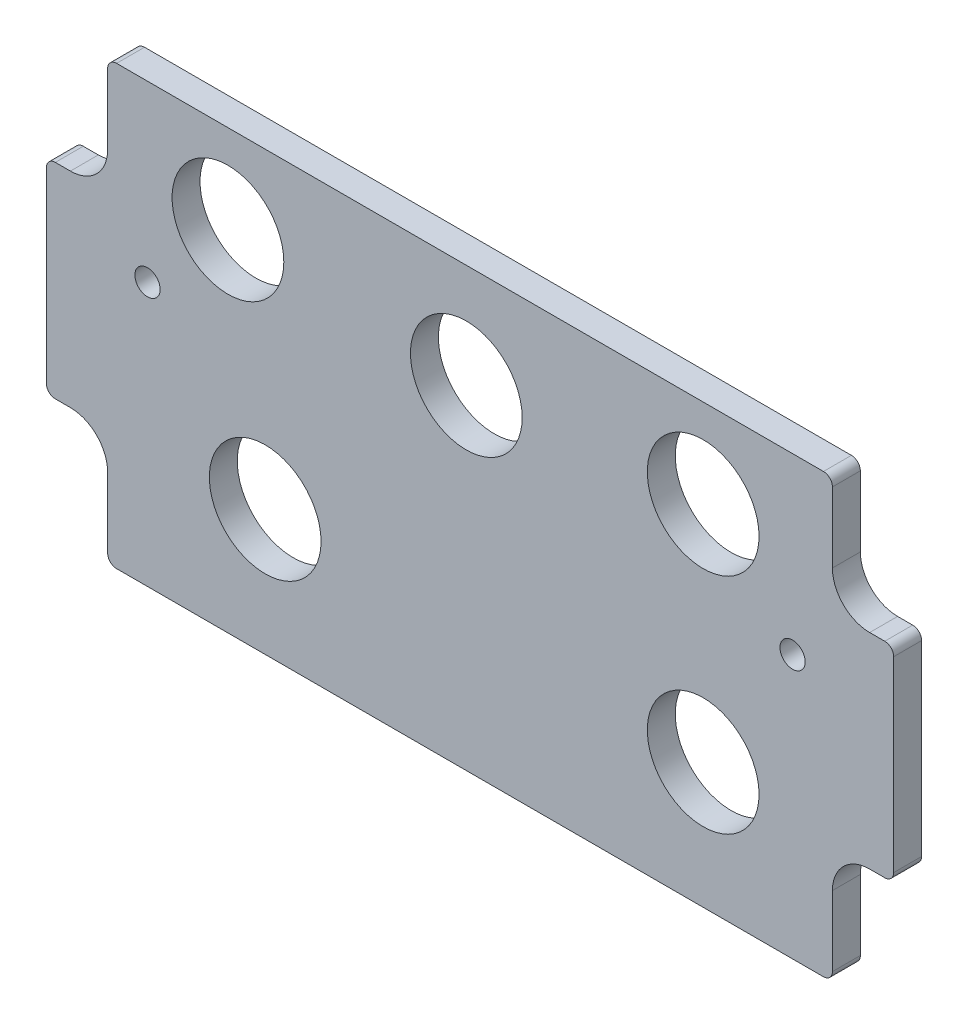
ISO-10303-21;
HEADER;
FILE_DESCRIPTION(('STEP AP214'),'2;1');
FILE_NAME('part.step','',(''),(''),'','','');
FILE_SCHEMA(('AUTOMOTIVE_DESIGN { 1 0 10303 214 1 1 1 1 }'));
ENDSEC;
DATA;
#1=APPLICATION_CONTEXT('core data for automotive mechanical design processes');
#2=APPLICATION_PROTOCOL_DEFINITION('international standard','automotive_design',2000,#1);
#3=PRODUCT_CONTEXT('',#1,'mechanical');
#4=PRODUCT('Part','Part','',(#3));
#5=PRODUCT_RELATED_PRODUCT_CATEGORY('part','',(#4));
#6=PRODUCT_DEFINITION_FORMATION('','',#4);
#7=PRODUCT_DEFINITION_CONTEXT('part definition',#1,'design');
#8=PRODUCT_DEFINITION('design','',#6,#7);
#9=PRODUCT_DEFINITION_SHAPE('','',#8);
#10=(LENGTH_UNIT() NAMED_UNIT(*) SI_UNIT(.MILLI.,.METRE.));
#11=(NAMED_UNIT(*) PLANE_ANGLE_UNIT() SI_UNIT($,.RADIAN.));
#12=(NAMED_UNIT(*) SI_UNIT($,.STERADIAN.) SOLID_ANGLE_UNIT());
#13=UNCERTAINTY_MEASURE_WITH_UNIT(LENGTH_MEASURE(1.E-05),#10,'distance_accuracy_value','');
#14=(GEOMETRIC_REPRESENTATION_CONTEXT(3) GLOBAL_UNCERTAINTY_ASSIGNED_CONTEXT((#13)) GLOBAL_UNIT_ASSIGNED_CONTEXT((#10,
#11,#12)) REPRESENTATION_CONTEXT('',''));
#15=CARTESIAN_POINT('',(0.,0.,0.));
#16=DIRECTION('',(0.,0.,1.));
#17=DIRECTION('',(1.,0.,0.));
#18=AXIS2_PLACEMENT_3D('',#15,#16,#17);
#19=CARTESIAN_POINT('',(141.1605,61.9125,4.7625));
#20=DIRECTION('',(0.,0.,-1.));
#21=DIRECTION('',(-1.,0.,0.));
#22=AXIS2_PLACEMENT_3D('',#19,#20,#21);
#23=CYLINDRICAL_SURFACE('',#22,6.34999999999994);
#24=CARTESIAN_POINT('',(141.1605,61.9125,0.));
#25=DIRECTION('',(0.,0.,-1.));
#26=DIRECTION('',(1.,0.,0.));
#27=AXIS2_PLACEMENT_3D('',#24,#25,#26);
#28=CIRCLE('',#27,6.34999999999994);
#29=CARTESIAN_POINT('',(141.160500000001,55.5625000000001,0.));
#30=VERTEX_POINT('',#29);
#31=CARTESIAN_POINT('',(134.8105,61.9125,0.));
#32=VERTEX_POINT('',#31);
#33=EDGE_CURVE('E243',#30,#32,#28,.T.);
#34=ORIENTED_EDGE('',*,*,#33,.T.);
#35=DIRECTION('',(0.,0.,-1.));
#36=VECTOR('',#35,1.);
#37=CARTESIAN_POINT('',(134.8105,61.9125,4.7625));
#38=LINE('',#37,#36);
#39=CARTESIAN_POINT('',(134.8105,61.9125,4.7625));
#40=VERTEX_POINT('',#39);
#41=EDGE_CURVE('E13',#40,#32,#38,.T.);
#42=ORIENTED_EDGE('',*,*,#41,.F.);
#43=CARTESIAN_POINT('',(141.1605,61.9125,4.7625));
#44=DIRECTION('',(0.,0.,-1.));
#45=DIRECTION('',(1.,0.,0.));
#46=AXIS2_PLACEMENT_3D('',#43,#44,#45);
#47=CIRCLE('',#46,6.34999999999994);
#48=CARTESIAN_POINT('',(141.160500000001,55.5625000000001,4.7625));
#49=VERTEX_POINT('',#48);
#50=EDGE_CURVE('E290',#49,#40,#47,.T.);
#51=ORIENTED_EDGE('',*,*,#50,.F.);
#52=DIRECTION('',(0.,0.,-1.));
#53=VECTOR('',#52,1.);
#54=CARTESIAN_POINT('',(141.160500000001,55.5625000000001,4.7625));
#55=LINE('',#54,#53);
#56=EDGE_CURVE('E239',#49,#30,#55,.T.);
#57=ORIENTED_EDGE('',*,*,#56,.T.);
#58=EDGE_LOOP('',(#34,#42,#51,#57));
#59=FACE_BOUND('',#58,.T.);
#60=ADVANCED_FACE('F51',(#59),#23,.F.);
#61=CARTESIAN_POINT('',(134.8105,61.9125,4.7625));
#62=DIRECTION('',(-1.,0.,0.));
#63=DIRECTION('',(0.,-1.,0.));
#64=AXIS2_PLACEMENT_3D('',#61,#62,#63);
#65=PLANE('',#64);
#66=DIRECTION('',(0.,1.,0.));
#67=VECTOR('',#66,1.);
#68=CARTESIAN_POINT('',(134.8105,61.9125,0.));
#69=LINE('',#68,#67);
#70=CARTESIAN_POINT('',(134.8105,73.88225,0.));
#71=VERTEX_POINT('',#70);
#72=EDGE_CURVE('E246',#32,#71,#69,.T.);
#73=ORIENTED_EDGE('',*,*,#72,.T.);
#74=DIRECTION('',(0.,0.,-1.));
#75=VECTOR('',#74,1.);
#76=CARTESIAN_POINT('',(134.8105,73.88225,4.7625));
#77=LINE('',#76,#75);
#78=CARTESIAN_POINT('',(134.8105,73.88225,4.7625));
#79=VERTEX_POINT('',#78);
#80=EDGE_CURVE('E59',#79,#71,#77,.T.);
#81=ORIENTED_EDGE('',*,*,#80,.F.);
#82=DIRECTION('',(0.,1.,0.));
#83=VECTOR('',#82,1.);
#84=CARTESIAN_POINT('',(134.8105,61.9125,4.7625));
#85=LINE('',#84,#83);
#86=EDGE_CURVE('E158',#40,#79,#85,.T.);
#87=ORIENTED_EDGE('',*,*,#86,.F.);
#88=ORIENTED_EDGE('',*,*,#41,.T.);
#89=EDGE_LOOP('',(#73,#81,#87,#88));
#90=FACE_BOUND('',#89,.T.);
#91=ADVANCED_FACE('F429',(#90),#65,.F.);
#92=CARTESIAN_POINT('',(133.2865,73.88225,4.7625));
#93=DIRECTION('',(0.,0.,-1.));
#94=DIRECTION('',(-1.,0.,0.));
#95=AXIS2_PLACEMENT_3D('',#92,#93,#94);
#96=CYLINDRICAL_SURFACE('',#95,1.52400000000003);
#97=CARTESIAN_POINT('',(133.2865,73.88225,0.));
#98=DIRECTION('',(0.,0.,1.));
#99=DIRECTION('',(1.,0.,0.));
#100=AXIS2_PLACEMENT_3D('',#97,#98,#99);
#101=CIRCLE('',#100,1.52400000000003);
#102=CARTESIAN_POINT('',(133.2865,75.40625,0.));
#103=VERTEX_POINT('',#102);
#104=EDGE_CURVE('E249',#71,#103,#101,.T.);
#105=ORIENTED_EDGE('',*,*,#104,.T.);
#106=DIRECTION('',(0.,0.,-1.));
#107=VECTOR('',#106,1.);
#108=CARTESIAN_POINT('',(133.2865,75.40625,4.7625));
#109=LINE('',#108,#107);
#110=CARTESIAN_POINT('',(133.2865,75.40625,4.7625));
#111=VERTEX_POINT('',#110);
#112=EDGE_CURVE('E345',#111,#103,#109,.T.);
#113=ORIENTED_EDGE('',*,*,#112,.F.);
#114=CARTESIAN_POINT('',(133.2865,73.88225,4.7625));
#115=DIRECTION('',(0.,0.,1.));
#116=DIRECTION('',(1.,0.,0.));
#117=AXIS2_PLACEMENT_3D('',#114,#115,#116);
#118=CIRCLE('',#117,1.52400000000003);
#119=EDGE_CURVE('E353',#79,#111,#118,.T.);
#120=ORIENTED_EDGE('',*,*,#119,.F.);
#121=ORIENTED_EDGE('',*,*,#80,.T.);
#122=EDGE_LOOP('',(#105,#113,#120,#121));
#123=FACE_BOUND('',#122,.T.);
#124=ADVANCED_FACE('F351',(#123),#96,.T.);
#125=CARTESIAN_POINT('',(133.2865,75.40625,4.7625));
#126=DIRECTION('',(0.,-1.,0.));
#127=DIRECTION('',(0.,0.,-1.));
#128=AXIS2_PLACEMENT_3D('',#125,#126,#127);
#129=PLANE('',#128);
#130=DIRECTION('',(-1.,0.,0.));
#131=VECTOR('',#130,1.);
#132=CARTESIAN_POINT('',(133.2865,75.40625,0.));
#133=LINE('',#132,#131);
#134=CARTESIAN_POINT('',(12.7635000000002,75.40625,0.));
#135=VERTEX_POINT('',#134);
#136=EDGE_CURVE('E251',#103,#135,#133,.T.);
#137=ORIENTED_EDGE('',*,*,#136,.T.);
#138=DIRECTION('',(0.,0.,-1.));
#139=VECTOR('',#138,1.);
#140=CARTESIAN_POINT('',(12.7635000000002,75.40625,4.7625));
#141=LINE('',#140,#139);
#142=CARTESIAN_POINT('',(12.7635000000002,75.40625,4.7625));
#143=VERTEX_POINT('',#142);
#144=EDGE_CURVE('E342',#143,#135,#141,.T.);
#145=ORIENTED_EDGE('',*,*,#144,.F.);
#146=DIRECTION('',(-1.,0.,0.));
#147=VECTOR('',#146,1.);
#148=CARTESIAN_POINT('',(133.2865,75.40625,4.7625));
#149=LINE('',#148,#147);
#150=EDGE_CURVE('E371',#111,#143,#149,.T.);
#151=ORIENTED_EDGE('',*,*,#150,.F.);
#152=ORIENTED_EDGE('',*,*,#112,.T.);
#153=EDGE_LOOP('',(#137,#145,#151,#152));
#154=FACE_BOUND('',#153,.T.);
#155=ADVANCED_FACE('F362',(#154),#129,.F.);
#156=CARTESIAN_POINT('',(12.7635000000002,73.88225,4.7625));
#157=DIRECTION('',(0.,0.,-1.));
#158=DIRECTION('',(-1.,0.,0.));
#159=AXIS2_PLACEMENT_3D('',#156,#157,#158);
#160=CYLINDRICAL_SURFACE('',#159,1.524);
#161=CARTESIAN_POINT('',(12.7635000000002,73.88225,0.));
#162=DIRECTION('',(0.,0.,1.));
#163=DIRECTION('',(1.,0.,0.));
#164=AXIS2_PLACEMENT_3D('',#161,#162,#163);
#165=CIRCLE('',#164,1.524);
#166=CARTESIAN_POINT('',(11.2395000000002,73.88225,0.));
#167=VERTEX_POINT('',#166);
#168=EDGE_CURVE('E253',#135,#167,#165,.T.);
#169=ORIENTED_EDGE('',*,*,#168,.T.);
#170=DIRECTION('',(0.,0.,-1.));
#171=VECTOR('',#170,1.);
#172=CARTESIAN_POINT('',(11.2395000000002,73.88225,4.7625));
#173=LINE('',#172,#171);
#174=CARTESIAN_POINT('',(11.2395000000002,73.88225,4.7625));
#175=VERTEX_POINT('',#174);
#176=EDGE_CURVE('E339',#175,#167,#173,.T.);
#177=ORIENTED_EDGE('',*,*,#176,.F.);
#178=CARTESIAN_POINT('',(12.7635000000002,73.88225,4.7625));
#179=DIRECTION('',(0.,0.,1.));
#180=DIRECTION('',(1.,0.,0.));
#181=AXIS2_PLACEMENT_3D('',#178,#179,#180);
#182=CIRCLE('',#181,1.524);
#183=EDGE_CURVE('E368',#143,#175,#182,.T.);
#184=ORIENTED_EDGE('',*,*,#183,.F.);
#185=ORIENTED_EDGE('',*,*,#144,.T.);
#186=EDGE_LOOP('',(#169,#177,#184,#185));
#187=FACE_BOUND('',#186,.T.);
#188=ADVANCED_FACE('F366',(#187),#160,.T.);
#189=CARTESIAN_POINT('',(11.2395000000002,73.88225,4.7625));
#190=DIRECTION('',(1.,0.,0.));
#191=DIRECTION('',(0.,1.,0.));
#192=AXIS2_PLACEMENT_3D('',#189,#190,#191);
#193=PLANE('',#192);
#194=DIRECTION('',(0.,-1.,0.));
#195=VECTOR('',#194,1.);
#196=CARTESIAN_POINT('',(11.2395000000002,73.88225,0.));
#197=LINE('',#196,#195);
#198=CARTESIAN_POINT('',(11.2395000000003,61.9125,0.));
#199=VERTEX_POINT('',#198);
#200=EDGE_CURVE('E255',#167,#199,#197,.T.);
#201=ORIENTED_EDGE('',*,*,#200,.T.);
#202=DIRECTION('',(0.,0.,-1.));
#203=VECTOR('',#202,1.);
#204=CARTESIAN_POINT('',(11.2395000000003,61.9125,4.7625));
#205=LINE('',#204,#203);
#206=CARTESIAN_POINT('',(11.2395000000003,61.9125,4.7625));
#207=VERTEX_POINT('',#206);
#208=EDGE_CURVE('E336',#207,#199,#205,.T.);
#209=ORIENTED_EDGE('',*,*,#208,.F.);
#210=DIRECTION('',(0.,-1.,0.));
#211=VECTOR('',#210,1.);
#212=CARTESIAN_POINT('',(11.2395000000002,73.88225,4.7625));
#213=LINE('',#212,#211);
#214=EDGE_CURVE('E370',#175,#207,#213,.T.);
#215=ORIENTED_EDGE('',*,*,#214,.F.);
#216=ORIENTED_EDGE('',*,*,#176,.T.);
#217=EDGE_LOOP('',(#201,#209,#215,#216));
#218=FACE_BOUND('',#217,.T.);
#219=ADVANCED_FACE('F442',(#218),#193,.F.);
#220=CARTESIAN_POINT('',(4.88950000000036,61.9125,4.7625));
#221=DIRECTION('',(0.,0.,-1.));
#222=DIRECTION('',(-1.,0.,0.));
#223=AXIS2_PLACEMENT_3D('',#220,#221,#222);
#224=CYLINDRICAL_SURFACE('',#223,6.34999999999997);
#225=CARTESIAN_POINT('',(4.88950000000036,61.9125,0.));
#226=DIRECTION('',(0.,0.,-1.));
#227=DIRECTION('',(1.,0.,0.));
#228=AXIS2_PLACEMENT_3D('',#225,#226,#227);
#229=CIRCLE('',#228,6.34999999999997);
#230=CARTESIAN_POINT('',(4.88950000000014,55.5625,0.));
#231=VERTEX_POINT('',#230);
#232=EDGE_CURVE('E257',#199,#231,#229,.T.);
#233=ORIENTED_EDGE('',*,*,#232,.T.);
#234=DIRECTION('',(0.,0.,-1.));
#235=VECTOR('',#234,1.);
#236=CARTESIAN_POINT('',(4.88950000000014,55.5625,4.7625));
#237=LINE('',#236,#235);
#238=CARTESIAN_POINT('',(4.88950000000014,55.5625,4.7625));
#239=VERTEX_POINT('',#238);
#240=EDGE_CURVE('E333',#239,#231,#237,.T.);
#241=ORIENTED_EDGE('',*,*,#240,.F.);
#242=CARTESIAN_POINT('',(4.88950000000036,61.9125,4.7625));
#243=DIRECTION('',(0.,0.,-1.));
#244=DIRECTION('',(1.,0.,0.));
#245=AXIS2_PLACEMENT_3D('',#242,#243,#244);
#246=CIRCLE('',#245,6.34999999999997);
#247=EDGE_CURVE('E373',#207,#239,#246,.T.);
#248=ORIENTED_EDGE('',*,*,#247,.F.);
#249=ORIENTED_EDGE('',*,*,#208,.T.);
#250=EDGE_LOOP('',(#233,#241,#248,#249));
#251=FACE_BOUND('',#250,.T.);
#252=ADVANCED_FACE('F445',(#251),#224,.F.);
#253=CARTESIAN_POINT('',(4.88950000000014,55.5625,4.7625));
#254=DIRECTION('',(0.,-1.,0.));
#255=DIRECTION('',(1.,0.,0.));
#256=AXIS2_PLACEMENT_3D('',#253,#254,#255);
#257=PLANE('',#256);
#258=DIRECTION('',(-1.,0.,0.));
#259=VECTOR('',#258,1.);
#260=CARTESIAN_POINT('',(4.88950000000014,55.5625,0.));
#261=LINE('',#260,#259);
#262=CARTESIAN_POINT('',(2.31775000000038,55.5625000000002,0.));
#263=VERTEX_POINT('',#262);
#264=EDGE_CURVE('E259',#231,#263,#261,.T.);
#265=ORIENTED_EDGE('',*,*,#264,.T.);
#266=DIRECTION('',(0.,0.,-1.));
#267=VECTOR('',#266,1.);
#268=CARTESIAN_POINT('',(2.31775000000038,55.5625000000002,4.7625));
#269=LINE('',#268,#267);
#270=CARTESIAN_POINT('',(2.31775000000038,55.5625000000002,4.7625));
#271=VERTEX_POINT('',#270);
#272=EDGE_CURVE('E330',#271,#263,#269,.T.);
#273=ORIENTED_EDGE('',*,*,#272,.F.);
#274=DIRECTION('',(-1.,0.,0.));
#275=VECTOR('',#274,1.);
#276=CARTESIAN_POINT('',(4.88950000000014,55.5625,4.7625));
#277=LINE('',#276,#275);
#278=EDGE_CURVE('E379',#239,#271,#277,.T.);
#279=ORIENTED_EDGE('',*,*,#278,.F.);
#280=ORIENTED_EDGE('',*,*,#240,.T.);
#281=EDGE_LOOP('',(#265,#273,#279,#280));
#282=FACE_BOUND('',#281,.T.);
#283=ADVANCED_FACE('F449',(#282),#257,.F.);
#284=CARTESIAN_POINT('',(2.31775000000033,54.0385000000003,4.7625));
#285=DIRECTION('',(0.,0.,-1.));
#286=DIRECTION('',(-1.,0.,0.));
#287=AXIS2_PLACEMENT_3D('',#284,#285,#286);
#288=CYLINDRICAL_SURFACE('',#287,1.52399999999997);
#289=CARTESIAN_POINT('',(2.31775000000033,54.0385000000003,0.));
#290=DIRECTION('',(0.,0.,1.));
#291=DIRECTION('',(1.,0.,0.));
#292=AXIS2_PLACEMENT_3D('',#289,#290,#291);
#293=CIRCLE('',#292,1.52399999999997);
#294=CARTESIAN_POINT('',(0.793750000000361,54.0385000000003,0.));
#295=VERTEX_POINT('',#294);
#296=EDGE_CURVE('E261',#263,#295,#293,.T.);
#297=ORIENTED_EDGE('',*,*,#296,.T.);
#298=DIRECTION('',(0.,0.,-1.));
#299=VECTOR('',#298,1.);
#300=CARTESIAN_POINT('',(0.79375000000036,54.0385000000003,4.7625));
#301=LINE('',#300,#299);
#302=CARTESIAN_POINT('',(0.79375000000036,54.0385000000003,4.7625));
#303=VERTEX_POINT('',#302);
#304=EDGE_CURVE('E327',#303,#295,#301,.T.);
#305=ORIENTED_EDGE('',*,*,#304,.F.);
#306=CARTESIAN_POINT('',(2.31775000000033,54.0385000000003,4.7625));
#307=DIRECTION('',(0.,0.,1.));
#308=DIRECTION('',(1.,0.,0.));
#309=AXIS2_PLACEMENT_3D('',#306,#307,#308);
#310=CIRCLE('',#309,1.52399999999997);
#311=EDGE_CURVE('E381',#271,#303,#310,.T.);
#312=ORIENTED_EDGE('',*,*,#311,.F.);
#313=ORIENTED_EDGE('',*,*,#272,.T.);
#314=EDGE_LOOP('',(#297,#305,#312,#313));
#315=FACE_BOUND('',#314,.T.);
#316=ADVANCED_FACE('F453',(#315),#288,.T.);
#317=CARTESIAN_POINT('',(0.793750000000328,54.0385000000003,4.7625));
#318=DIRECTION('',(1.,0.,0.));
#319=DIRECTION('',(0.,1.,0.));
#320=AXIS2_PLACEMENT_3D('',#317,#318,#319);
#321=PLANE('',#320);
#322=DIRECTION('',(0.,-1.,0.));
#323=VECTOR('',#322,1.);
#324=CARTESIAN_POINT('',(0.793750000000328,54.0385000000003,0.));
#325=LINE('',#324,#323);
#326=CARTESIAN_POINT('',(0.793750000000338,22.1614999999998,0.));
#327=VERTEX_POINT('',#326);
#328=EDGE_CURVE('E263',#295,#327,#325,.T.);
#329=ORIENTED_EDGE('',*,*,#328,.T.);
#330=DIRECTION('',(0.,0.,-1.));
#331=VECTOR('',#330,1.);
#332=CARTESIAN_POINT('',(0.793750000000338,22.1614999999998,4.7625));
#333=LINE('',#332,#331);
#334=CARTESIAN_POINT('',(0.793750000000338,22.1614999999998,4.7625));
#335=VERTEX_POINT('',#334);
#336=EDGE_CURVE('E324',#335,#327,#333,.T.);
#337=ORIENTED_EDGE('',*,*,#336,.F.);
#338=DIRECTION('',(0.,-1.,0.));
#339=VECTOR('',#338,1.);
#340=CARTESIAN_POINT('',(0.793750000000328,54.0385000000003,4.7625));
#341=LINE('',#340,#339);
#342=EDGE_CURVE('E383',#303,#335,#341,.T.);
#343=ORIENTED_EDGE('',*,*,#342,.F.);
#344=ORIENTED_EDGE('',*,*,#304,.T.);
#345=EDGE_LOOP('',(#329,#337,#343,#344));
#346=FACE_BOUND('',#345,.T.);
#347=ADVANCED_FACE('F457',(#346),#321,.F.);
#348=CARTESIAN_POINT('',(2.31775000000033,22.1614999999998,4.7625));
#349=DIRECTION('',(0.,0.,-1.));
#350=DIRECTION('',(-1.,0.,0.));
#351=AXIS2_PLACEMENT_3D('',#348,#349,#350);
#352=CYLINDRICAL_SURFACE('',#351,1.52399999999999);
#353=CARTESIAN_POINT('',(2.31775000000033,22.1614999999998,0.));
#354=DIRECTION('',(0.,0.,1.));
#355=DIRECTION('',(1.,0.,0.));
#356=AXIS2_PLACEMENT_3D('',#353,#354,#355);
#357=CIRCLE('',#356,1.52399999999999);
#358=CARTESIAN_POINT('',(2.31775000000038,20.6374999999999,0.));
#359=VERTEX_POINT('',#358);
#360=EDGE_CURVE('E265',#327,#359,#357,.T.);
#361=ORIENTED_EDGE('',*,*,#360,.T.);
#362=DIRECTION('',(0.,0.,-1.));
#363=VECTOR('',#362,1.);
#364=CARTESIAN_POINT('',(2.31775000000038,20.6374999999999,4.7625));
#365=LINE('',#364,#363);
#366=CARTESIAN_POINT('',(2.31775000000038,20.6374999999999,4.7625));
#367=VERTEX_POINT('',#366);
#368=EDGE_CURVE('E321',#367,#359,#365,.T.);
#369=ORIENTED_EDGE('',*,*,#368,.F.);
#370=CARTESIAN_POINT('',(2.31775000000033,22.1614999999998,4.7625));
#371=DIRECTION('',(0.,0.,1.));
#372=DIRECTION('',(1.,0.,0.));
#373=AXIS2_PLACEMENT_3D('',#370,#371,#372);
#374=CIRCLE('',#373,1.52399999999999);
#375=EDGE_CURVE('E385',#335,#367,#374,.T.);
#376=ORIENTED_EDGE('',*,*,#375,.F.);
#377=ORIENTED_EDGE('',*,*,#336,.T.);
#378=EDGE_LOOP('',(#361,#369,#376,#377));
#379=FACE_BOUND('',#378,.T.);
#380=ADVANCED_FACE('F461',(#379),#352,.T.);
#381=CARTESIAN_POINT('',(2.31775000000038,20.6374999999999,4.7625));
#382=DIRECTION('',(0.,1.,0.));
#383=DIRECTION('',(-1.,0.,0.));
#384=AXIS2_PLACEMENT_3D('',#381,#382,#383);
#385=PLANE('',#384);
#386=DIRECTION('',(1.,0.,0.));
#387=VECTOR('',#386,1.);
#388=CARTESIAN_POINT('',(2.31775000000038,20.6374999999999,0.));
#389=LINE('',#388,#387);
#390=CARTESIAN_POINT('',(4.88950000000014,20.6375,0.));
#391=VERTEX_POINT('',#390);
#392=EDGE_CURVE('E267',#359,#391,#389,.T.);
#393=ORIENTED_EDGE('',*,*,#392,.T.);
#394=DIRECTION('',(0.,0.,-1.));
#395=VECTOR('',#394,1.);
#396=CARTESIAN_POINT('',(4.88950000000014,20.6375,4.7625));
#397=LINE('',#396,#395);
#398=CARTESIAN_POINT('',(4.88950000000014,20.6375,4.7625));
#399=VERTEX_POINT('',#398);
#400=EDGE_CURVE('E318',#399,#391,#397,.T.);
#401=ORIENTED_EDGE('',*,*,#400,.F.);
#402=DIRECTION('',(1.,0.,0.));
#403=VECTOR('',#402,1.);
#404=CARTESIAN_POINT('',(2.31775000000038,20.6374999999999,4.7625));
#405=LINE('',#404,#403);
#406=EDGE_CURVE('E387',#367,#399,#405,.T.);
#407=ORIENTED_EDGE('',*,*,#406,.F.);
#408=ORIENTED_EDGE('',*,*,#368,.T.);
#409=EDGE_LOOP('',(#393,#401,#407,#408));
#410=FACE_BOUND('',#409,.T.);
#411=ADVANCED_FACE('F465',(#410),#385,.F.);
#412=CARTESIAN_POINT('',(4.88950000000036,14.2875,4.7625));
#413=DIRECTION('',(0.,0.,-1.));
#414=DIRECTION('',(-1.,0.,0.));
#415=AXIS2_PLACEMENT_3D('',#412,#413,#414);
#416=CYLINDRICAL_SURFACE('',#415,6.34999999999998);
#417=CARTESIAN_POINT('',(4.88950000000036,14.2875,0.));
#418=DIRECTION('',(0.,0.,-1.));
#419=DIRECTION('',(1.,0.,0.));
#420=AXIS2_PLACEMENT_3D('',#417,#418,#419);
#421=CIRCLE('',#420,6.34999999999998);
#422=CARTESIAN_POINT('',(11.2395000000003,14.2875,0.));
#423=VERTEX_POINT('',#422);
#424=EDGE_CURVE('E269',#391,#423,#421,.T.);
#425=ORIENTED_EDGE('',*,*,#424,.T.);
#426=DIRECTION('',(0.,0.,-1.));
#427=VECTOR('',#426,1.);
#428=CARTESIAN_POINT('',(11.2395000000003,14.2875,4.7625));
#429=LINE('',#428,#427);
#430=CARTESIAN_POINT('',(11.2395000000003,14.2875,4.7625));
#431=VERTEX_POINT('',#430);
#432=EDGE_CURVE('E315',#431,#423,#429,.T.);
#433=ORIENTED_EDGE('',*,*,#432,.F.);
#434=CARTESIAN_POINT('',(4.88950000000036,14.2875,4.7625));
#435=DIRECTION('',(0.,0.,-1.));
#436=DIRECTION('',(1.,0.,0.));
#437=AXIS2_PLACEMENT_3D('',#434,#435,#436);
#438=CIRCLE('',#437,6.34999999999998);
#439=EDGE_CURVE('E389',#399,#431,#438,.T.);
#440=ORIENTED_EDGE('',*,*,#439,.F.);
#441=ORIENTED_EDGE('',*,*,#400,.T.);
#442=EDGE_LOOP('',(#425,#433,#440,#441));
#443=FACE_BOUND('',#442,.T.);
#444=ADVANCED_FACE('F469',(#443),#416,.F.);
#445=CARTESIAN_POINT('',(11.2395000000004,14.2875,4.7625));
#446=DIRECTION('',(1.,0.,0.));
#447=DIRECTION('',(0.,1.,0.));
#448=AXIS2_PLACEMENT_3D('',#445,#446,#447);
#449=PLANE('',#448);
#450=DIRECTION('',(0.,-1.,0.));
#451=VECTOR('',#450,1.);
#452=CARTESIAN_POINT('',(11.2395000000004,14.2875,0.));
#453=LINE('',#452,#451);
#454=CARTESIAN_POINT('',(11.2395000000002,2.31775000000006,0.));
#455=VERTEX_POINT('',#454);
#456=EDGE_CURVE('E271',#423,#455,#453,.T.);
#457=ORIENTED_EDGE('',*,*,#456,.T.);
#458=DIRECTION('',(0.,0.,-1.));
#459=VECTOR('',#458,1.);
#460=CARTESIAN_POINT('',(11.2395000000002,2.31775000000006,4.7625));
#461=LINE('',#460,#459);
#462=CARTESIAN_POINT('',(11.2395000000002,2.31775000000006,4.7625));
#463=VERTEX_POINT('',#462);
#464=EDGE_CURVE('E312',#463,#455,#461,.T.);
#465=ORIENTED_EDGE('',*,*,#464,.F.);
#466=DIRECTION('',(0.,-1.,0.));
#467=VECTOR('',#466,1.);
#468=CARTESIAN_POINT('',(11.2395000000004,14.2875,4.7625));
#469=LINE('',#468,#467);
#470=EDGE_CURVE('E391',#431,#463,#469,.T.);
#471=ORIENTED_EDGE('',*,*,#470,.F.);
#472=ORIENTED_EDGE('',*,*,#432,.T.);
#473=EDGE_LOOP('',(#457,#465,#471,#472));
#474=FACE_BOUND('',#473,.T.);
#475=ADVANCED_FACE('F473',(#474),#449,.F.);
#476=CARTESIAN_POINT('',(12.7635000000002,2.31775000000005,4.7625));
#477=DIRECTION('',(0.,0.,-1.));
#478=DIRECTION('',(-1.,0.,0.));
#479=AXIS2_PLACEMENT_3D('',#476,#477,#478);
#480=CYLINDRICAL_SURFACE('',#479,1.52399999999998);
#481=CARTESIAN_POINT('',(12.7635000000002,2.31775000000005,0.));
#482=DIRECTION('',(0.,0.,1.));
#483=DIRECTION('',(1.,0.,0.));
#484=AXIS2_PLACEMENT_3D('',#481,#482,#483);
#485=CIRCLE('',#484,1.52399999999998);
#486=CARTESIAN_POINT('',(12.7635000000002,0.793750000000068,0.));
#487=VERTEX_POINT('',#486);
#488=EDGE_CURVE('E273',#455,#487,#485,.T.);
#489=ORIENTED_EDGE('',*,*,#488,.T.);
#490=DIRECTION('',(0.,0.,-1.));
#491=VECTOR('',#490,1.);
#492=CARTESIAN_POINT('',(12.7635000000002,0.793750000000068,4.7625));
#493=LINE('',#492,#491);
#494=CARTESIAN_POINT('',(12.7635000000002,0.793750000000068,4.7625));
#495=VERTEX_POINT('',#494);
#496=EDGE_CURVE('E309',#495,#487,#493,.T.);
#497=ORIENTED_EDGE('',*,*,#496,.F.);
#498=CARTESIAN_POINT('',(12.7635000000002,2.31775000000005,4.7625));
#499=DIRECTION('',(0.,0.,1.));
#500=DIRECTION('',(1.,0.,0.));
#501=AXIS2_PLACEMENT_3D('',#498,#499,#500);
#502=CIRCLE('',#501,1.52399999999998);
#503=EDGE_CURVE('E393',#463,#495,#502,.T.);
#504=ORIENTED_EDGE('',*,*,#503,.F.);
#505=ORIENTED_EDGE('',*,*,#464,.T.);
#506=EDGE_LOOP('',(#489,#497,#504,#505));
#507=FACE_BOUND('',#506,.T.);
#508=ADVANCED_FACE('F477',(#507),#480,.T.);
#509=CARTESIAN_POINT('',(12.7635000000002,0.793750000000044,4.7625));
#510=DIRECTION('',(0.,1.,0.));
#511=DIRECTION('',(-1.,0.,0.));
#512=AXIS2_PLACEMENT_3D('',#509,#510,#511);
#513=PLANE('',#512);
#514=DIRECTION('',(1.,0.,0.));
#515=VECTOR('',#514,1.);
#516=CARTESIAN_POINT('',(12.7635000000002,0.793750000000044,0.));
#517=LINE('',#516,#515);
#518=CARTESIAN_POINT('',(133.286500000001,0.79374999999998,0.));
#519=VERTEX_POINT('',#518);
#520=EDGE_CURVE('E275',#487,#519,#517,.T.);
#521=ORIENTED_EDGE('',*,*,#520,.T.);
#522=DIRECTION('',(0.,0.,-1.));
#523=VECTOR('',#522,1.);
#524=CARTESIAN_POINT('',(133.286500000001,0.79374999999998,4.7625));
#525=LINE('',#524,#523);
#526=CARTESIAN_POINT('',(133.286500000001,0.79374999999998,4.7625));
#527=VERTEX_POINT('',#526);
#528=EDGE_CURVE('E306',#527,#519,#525,.T.);
#529=ORIENTED_EDGE('',*,*,#528,.F.);
#530=DIRECTION('',(1.,0.,0.));
#531=VECTOR('',#530,1.);
#532=CARTESIAN_POINT('',(12.7635000000002,0.793750000000044,4.7625));
#533=LINE('',#532,#531);
#534=EDGE_CURVE('E395',#495,#527,#533,.T.);
#535=ORIENTED_EDGE('',*,*,#534,.F.);
#536=ORIENTED_EDGE('',*,*,#496,.T.);
#537=EDGE_LOOP('',(#521,#529,#535,#536));
#538=FACE_BOUND('',#537,.T.);
#539=ADVANCED_FACE('F481',(#538),#513,.F.);
#540=CARTESIAN_POINT('',(133.286500000001,2.31774999999994,4.7625));
#541=DIRECTION('',(0.,0.,-1.));
#542=DIRECTION('',(-1.,0.,0.));
#543=AXIS2_PLACEMENT_3D('',#540,#541,#542);
#544=CYLINDRICAL_SURFACE('',#543,1.52399999999996);
#545=CARTESIAN_POINT('',(133.286500000001,2.31774999999994,0.));
#546=DIRECTION('',(0.,0.,1.));
#547=DIRECTION('',(1.,0.,0.));
#548=AXIS2_PLACEMENT_3D('',#545,#546,#547);
#549=CIRCLE('',#548,1.52399999999996);
#550=CARTESIAN_POINT('',(134.810500000001,2.31774999999995,0.));
#551=VERTEX_POINT('',#550);
#552=EDGE_CURVE('E277',#519,#551,#549,.T.);
#553=ORIENTED_EDGE('',*,*,#552,.T.);
#554=DIRECTION('',(0.,0.,-1.));
#555=VECTOR('',#554,1.);
#556=CARTESIAN_POINT('',(134.810500000001,2.31774999999995,4.7625));
#557=LINE('',#556,#555);
#558=CARTESIAN_POINT('',(134.810500000001,2.31774999999995,4.7625));
#559=VERTEX_POINT('',#558);
#560=EDGE_CURVE('E303',#559,#551,#557,.T.);
#561=ORIENTED_EDGE('',*,*,#560,.F.);
#562=CARTESIAN_POINT('',(133.286500000001,2.31774999999994,4.7625));
#563=DIRECTION('',(0.,0.,1.));
#564=DIRECTION('',(1.,0.,0.));
#565=AXIS2_PLACEMENT_3D('',#562,#563,#564);
#566=CIRCLE('',#565,1.52399999999996);
#567=EDGE_CURVE('E397',#527,#559,#566,.T.);
#568=ORIENTED_EDGE('',*,*,#567,.F.);
#569=ORIENTED_EDGE('',*,*,#528,.T.);
#570=EDGE_LOOP('',(#553,#561,#568,#569));
#571=FACE_BOUND('',#570,.T.);
#572=ADVANCED_FACE('F485',(#571),#544,.T.);
#573=CARTESIAN_POINT('',(134.810500000001,2.31774999999995,4.7625));
#574=DIRECTION('',(-1.,0.,0.));
#575=DIRECTION('',(0.,-1.,0.));
#576=AXIS2_PLACEMENT_3D('',#573,#574,#575);
#577=PLANE('',#576);
#578=DIRECTION('',(0.,1.,0.));
#579=VECTOR('',#578,1.);
#580=CARTESIAN_POINT('',(134.810500000001,2.31774999999995,0.));
#581=LINE('',#580,#579);
#582=CARTESIAN_POINT('',(134.8105,14.2875,0.));
#583=VERTEX_POINT('',#582);
#584=EDGE_CURVE('E279',#551,#583,#581,.T.);
#585=ORIENTED_EDGE('',*,*,#584,.T.);
#586=DIRECTION('',(0.,0.,-1.));
#587=VECTOR('',#586,1.);
#588=CARTESIAN_POINT('',(134.8105,14.2875,4.7625));
#589=LINE('',#588,#587);
#590=CARTESIAN_POINT('',(134.8105,14.2875,4.7625));
#591=VERTEX_POINT('',#590);
#592=EDGE_CURVE('E300',#591,#583,#589,.T.);
#593=ORIENTED_EDGE('',*,*,#592,.F.);
#594=DIRECTION('',(0.,1.,0.));
#595=VECTOR('',#594,1.);
#596=CARTESIAN_POINT('',(134.810500000001,2.31774999999995,4.7625));
#597=LINE('',#596,#595);
#598=EDGE_CURVE('E399',#559,#591,#597,.T.);
#599=ORIENTED_EDGE('',*,*,#598,.F.);
#600=ORIENTED_EDGE('',*,*,#560,.T.);
#601=EDGE_LOOP('',(#585,#593,#599,#600));
#602=FACE_BOUND('',#601,.T.);
#603=ADVANCED_FACE('F489',(#602),#577,.F.);
#604=CARTESIAN_POINT('',(141.1605,14.2875,4.7625));
#605=DIRECTION('',(0.,0.,-1.));
#606=DIRECTION('',(-1.,0.,0.));
#607=AXIS2_PLACEMENT_3D('',#604,#605,#606);
#608=CYLINDRICAL_SURFACE('',#607,6.34999999999997);
#609=CARTESIAN_POINT('',(141.1605,14.2875,0.));
#610=DIRECTION('',(0.,0.,-1.));
#611=DIRECTION('',(1.,0.,0.));
#612=AXIS2_PLACEMENT_3D('',#609,#610,#611);
#613=CIRCLE('',#612,6.34999999999997);
#614=CARTESIAN_POINT('',(141.160500000001,20.6375,0.));
#615=VERTEX_POINT('',#614);
#616=EDGE_CURVE('E281',#583,#615,#613,.T.);
#617=ORIENTED_EDGE('',*,*,#616,.T.);
#618=DIRECTION('',(0.,0.,-1.));
#619=VECTOR('',#618,1.);
#620=CARTESIAN_POINT('',(141.160500000001,20.6375,4.7625));
#621=LINE('',#620,#619);
#622=CARTESIAN_POINT('',(141.160500000001,20.6375,4.7625));
#623=VERTEX_POINT('',#622);
#624=EDGE_CURVE('E297',#623,#615,#621,.T.);
#625=ORIENTED_EDGE('',*,*,#624,.F.);
#626=CARTESIAN_POINT('',(141.1605,14.2875,4.7625));
#627=DIRECTION('',(0.,0.,-1.));
#628=DIRECTION('',(1.,0.,0.));
#629=AXIS2_PLACEMENT_3D('',#626,#627,#628);
#630=CIRCLE('',#629,6.34999999999997);
#631=EDGE_CURVE('E401',#591,#623,#630,.T.);
#632=ORIENTED_EDGE('',*,*,#631,.F.);
#633=ORIENTED_EDGE('',*,*,#592,.T.);
#634=EDGE_LOOP('',(#617,#625,#632,#633));
#635=FACE_BOUND('',#634,.T.);
#636=ADVANCED_FACE('F493',(#635),#608,.F.);
#637=CARTESIAN_POINT('',(141.160500000001,20.6375,4.7625));
#638=DIRECTION('',(0.,1.,0.));
#639=DIRECTION('',(-1.,0.,0.));
#640=AXIS2_PLACEMENT_3D('',#637,#638,#639);
#641=PLANE('',#640);
#642=DIRECTION('',(1.,0.,0.));
#643=VECTOR('',#642,1.);
#644=CARTESIAN_POINT('',(141.160500000001,20.6375,0.));
#645=LINE('',#644,#643);
#646=CARTESIAN_POINT('',(143.73225,20.6374999999999,0.));
#647=VERTEX_POINT('',#646);
#648=EDGE_CURVE('E283',#615,#647,#645,.T.);
#649=ORIENTED_EDGE('',*,*,#648,.T.);
#650=DIRECTION('',(0.,0.,-1.));
#651=VECTOR('',#650,1.);
#652=CARTESIAN_POINT('',(143.73225,20.6374999999999,4.7625));
#653=LINE('',#652,#651);
#654=CARTESIAN_POINT('',(143.73225,20.6374999999999,4.7625));
#655=VERTEX_POINT('',#654);
#656=EDGE_CURVE('E294',#655,#647,#653,.T.);
#657=ORIENTED_EDGE('',*,*,#656,.F.);
#658=DIRECTION('',(1.,0.,0.));
#659=VECTOR('',#658,1.);
#660=CARTESIAN_POINT('',(141.160500000001,20.6375,4.7625));
#661=LINE('',#660,#659);
#662=EDGE_CURVE('E403',#623,#655,#661,.T.);
#663=ORIENTED_EDGE('',*,*,#662,.F.);
#664=ORIENTED_EDGE('',*,*,#624,.T.);
#665=EDGE_LOOP('',(#649,#657,#663,#664));
#666=FACE_BOUND('',#665,.T.);
#667=ADVANCED_FACE('F409',(#666),#641,.F.);
#668=CARTESIAN_POINT('',(143.73225,22.1614999999998,4.7625));
#669=DIRECTION('',(0.,0.,-1.));
#670=DIRECTION('',(-1.,0.,0.));
#671=AXIS2_PLACEMENT_3D('',#668,#669,#670);
#672=CYLINDRICAL_SURFACE('',#671,1.52399999999997);
#673=CARTESIAN_POINT('',(143.73225,22.1614999999998,0.));
#674=DIRECTION('',(0.,0.,1.));
#675=DIRECTION('',(1.,0.,0.));
#676=AXIS2_PLACEMENT_3D('',#673,#674,#675);
#677=CIRCLE('',#676,1.52399999999997);
#678=CARTESIAN_POINT('',(145.25625,22.1614999999998,0.));
#679=VERTEX_POINT('',#678);
#680=EDGE_CURVE('E285',#647,#679,#677,.T.);
#681=ORIENTED_EDGE('',*,*,#680,.T.);
#682=DIRECTION('',(0.,0.,-1.));
#683=VECTOR('',#682,1.);
#684=CARTESIAN_POINT('',(145.25625,22.1614999999998,4.7625));
#685=LINE('',#684,#683);
#686=CARTESIAN_POINT('',(145.25625,22.1614999999998,4.7625));
#687=VERTEX_POINT('',#686);
#688=EDGE_CURVE('E234',#687,#679,#685,.T.);
#689=ORIENTED_EDGE('',*,*,#688,.F.);
#690=CARTESIAN_POINT('',(143.73225,22.1614999999998,4.7625));
#691=DIRECTION('',(0.,0.,1.));
#692=DIRECTION('',(1.,0.,0.));
#693=AXIS2_PLACEMENT_3D('',#690,#691,#692);
#694=CIRCLE('',#693,1.52399999999997);
#695=EDGE_CURVE('E225',#655,#687,#694,.T.);
#696=ORIENTED_EDGE('',*,*,#695,.F.);
#697=ORIENTED_EDGE('',*,*,#656,.T.);
#698=EDGE_LOOP('',(#681,#689,#696,#697));
#699=FACE_BOUND('',#698,.T.);
#700=ADVANCED_FACE('F413',(#699),#672,.T.);
#701=CARTESIAN_POINT('',(145.25625,22.1614999999998,4.7625));
#702=DIRECTION('',(-1.,0.,0.));
#703=DIRECTION('',(0.,-1.,0.));
#704=AXIS2_PLACEMENT_3D('',#701,#702,#703);
#705=PLANE('',#704);
#706=DIRECTION('',(0.,1.,0.));
#707=VECTOR('',#706,1.);
#708=CARTESIAN_POINT('',(145.25625,22.1614999999998,0.));
#709=LINE('',#708,#707);
#710=CARTESIAN_POINT('',(145.25625,54.0385000000003,0.));
#711=VERTEX_POINT('',#710);
#712=EDGE_CURVE('E233',#679,#711,#709,.T.);
#713=ORIENTED_EDGE('',*,*,#712,.T.);
#714=DIRECTION('',(0.,0.,-1.));
#715=VECTOR('',#714,1.);
#716=CARTESIAN_POINT('',(145.25625,54.0385000000003,4.7625));
#717=LINE('',#716,#715);
#718=CARTESIAN_POINT('',(145.25625,54.0385000000003,4.7625));
#719=VERTEX_POINT('',#718);
#720=EDGE_CURVE('E230',#719,#711,#717,.T.);
#721=ORIENTED_EDGE('',*,*,#720,.F.);
#722=DIRECTION('',(0.,1.,0.));
#723=VECTOR('',#722,1.);
#724=CARTESIAN_POINT('',(145.25625,22.1614999999998,4.7625));
#725=LINE('',#724,#723);
#726=EDGE_CURVE('E219',#687,#719,#725,.T.);
#727=ORIENTED_EDGE('',*,*,#726,.F.);
#728=ORIENTED_EDGE('',*,*,#688,.T.);
#729=EDGE_LOOP('',(#713,#721,#727,#728));
#730=FACE_BOUND('',#729,.T.);
#731=ADVANCED_FACE('F231',(#730),#705,.F.);
#732=CARTESIAN_POINT('',(143.73225,54.0385000000003,4.7625));
#733=DIRECTION('',(0.,0.,-1.));
#734=DIRECTION('',(-1.,0.,0.));
#735=AXIS2_PLACEMENT_3D('',#732,#733,#734);
#736=CYLINDRICAL_SURFACE('',#735,1.52399999999996);
#737=CARTESIAN_POINT('',(143.73225,54.0385000000003,0.));
#738=DIRECTION('',(0.,0.,1.));
#739=DIRECTION('',(1.,0.,0.));
#740=AXIS2_PLACEMENT_3D('',#737,#738,#739);
#741=CIRCLE('',#740,1.52399999999996);
#742=CARTESIAN_POINT('',(143.73225,55.5625000000002,0.));
#743=VERTEX_POINT('',#742);
#744=EDGE_CURVE('E144',#711,#743,#741,.T.);
#745=ORIENTED_EDGE('',*,*,#744,.T.);
#746=DIRECTION('',(0.,0.,-1.));
#747=VECTOR('',#746,1.);
#748=CARTESIAN_POINT('',(143.73225,55.5625000000002,4.7625));
#749=LINE('',#748,#747);
#750=CARTESIAN_POINT('',(143.73225,55.5625000000002,4.7625));
#751=VERTEX_POINT('',#750);
#752=EDGE_CURVE('E235',#751,#743,#749,.T.);
#753=ORIENTED_EDGE('',*,*,#752,.F.);
#754=CARTESIAN_POINT('',(143.73225,54.0385000000003,4.7625));
#755=DIRECTION('',(0.,0.,1.));
#756=DIRECTION('',(1.,0.,0.));
#757=AXIS2_PLACEMENT_3D('',#754,#755,#756);
#758=CIRCLE('',#757,1.52399999999996);
#759=EDGE_CURVE('E223',#719,#751,#758,.T.);
#760=ORIENTED_EDGE('',*,*,#759,.F.);
#761=ORIENTED_EDGE('',*,*,#720,.T.);
#762=EDGE_LOOP('',(#745,#753,#760,#761));
#763=FACE_BOUND('',#762,.T.);
#764=ADVANCED_FACE('F237',(#763),#736,.T.);
#765=CARTESIAN_POINT('',(143.73225,55.5625000000002,4.7625));
#766=DIRECTION('',(0.,-1.,0.));
#767=DIRECTION('',(1.,0.,0.));
#768=AXIS2_PLACEMENT_3D('',#765,#766,#767);
#769=PLANE('',#768);
#770=DIRECTION('',(-1.,0.,0.));
#771=VECTOR('',#770,1.);
#772=CARTESIAN_POINT('',(143.73225,55.5625000000002,0.));
#773=LINE('',#772,#771);
#774=EDGE_CURVE('E150',#743,#30,#773,.T.);
#775=ORIENTED_EDGE('',*,*,#774,.T.);
#776=ORIENTED_EDGE('',*,*,#56,.F.);
#777=DIRECTION('',(-1.,0.,0.));
#778=VECTOR('',#777,1.);
#779=CARTESIAN_POINT('',(143.73225,55.5625000000002,4.7625));
#780=LINE('',#779,#778);
#781=EDGE_CURVE('E67',#751,#49,#780,.T.);
#782=ORIENTED_EDGE('',*,*,#781,.F.);
#783=ORIENTED_EDGE('',*,*,#752,.T.);
#784=EDGE_LOOP('',(#775,#776,#782,#783));
#785=FACE_BOUND('',#784,.T.);
#786=ADVANCED_FACE('F417',(#785),#769,.F.);
#787=CARTESIAN_POINT('',(141.1605,61.9125,4.7625));
#788=DIRECTION('',(0.,0.,1.));
#789=DIRECTION('',(1.,0.,0.));
#790=AXIS2_PLACEMENT_3D('',#787,#788,#789);
#791=PLANE('',#790);
#792=CARTESIAN_POINT('',(18.0340000000003,45.72,4.7625));
#793=DIRECTION('',(0.,0.,1.));
#794=DIRECTION('',(1.,0.,0.));
#795=AXIS2_PLACEMENT_3D('',#792,#793,#794);
#796=CIRCLE('',#795,2.15265);
#797=CARTESIAN_POINT('',(20.1866500000003,45.72,4.7625));
#798=VERTEX_POINT('',#797);
#799=EDGE_CURVE('E587',#798,#798,#796,.T.);
#800=ORIENTED_EDGE('',*,*,#799,.F.);
#801=EDGE_LOOP('',(#800));
#802=FACE_BOUND('',#801,.T.);
#803=CARTESIAN_POINT('',(128.016,45.72,4.7625));
#804=DIRECTION('',(0.,0.,1.));
#805=DIRECTION('',(1.,0.,0.));
#806=AXIS2_PLACEMENT_3D('',#803,#804,#805);
#807=CIRCLE('',#806,2.15265000000001);
#808=CARTESIAN_POINT('',(130.16865,45.72,4.7625));
#809=VERTEX_POINT('',#808);
#810=EDGE_CURVE('E589',#809,#809,#807,.T.);
#811=ORIENTED_EDGE('',*,*,#810,.F.);
#812=EDGE_LOOP('',(#811));
#813=FACE_BOUND('',#812,.T.);
#814=CARTESIAN_POINT('',(31.7500000000003,60.325,4.7625));
#815=DIRECTION('',(0.,0.,1.));
#816=DIRECTION('',(1.,0.,0.));
#817=AXIS2_PLACEMENT_3D('',#814,#815,#816);
#818=CIRCLE('',#817,9.525);
#819=CARTESIAN_POINT('',(41.2750000000003,60.325,4.7625));
#820=VERTEX_POINT('',#819);
#821=EDGE_CURVE('E597',#820,#820,#818,.T.);
#822=ORIENTED_EDGE('',*,*,#821,.F.);
#823=EDGE_LOOP('',(#822));
#824=FACE_BOUND('',#823,.T.);
#825=CARTESIAN_POINT('',(72.3900000000003,57.658,4.7625));
#826=DIRECTION('',(0.,0.,1.));
#827=DIRECTION('',(1.,0.,0.));
#828=AXIS2_PLACEMENT_3D('',#825,#826,#827);
#829=CIRCLE('',#828,9.52499999999999);
#830=CARTESIAN_POINT('',(81.9150000000003,57.658,4.7625));
#831=VERTEX_POINT('',#830);
#832=EDGE_CURVE('E603',#831,#831,#829,.T.);
#833=ORIENTED_EDGE('',*,*,#832,.F.);
#834=EDGE_LOOP('',(#833));
#835=FACE_BOUND('',#834,.T.);
#836=CARTESIAN_POINT('',(112.776,60.325,4.7625));
#837=DIRECTION('',(0.,0.,1.));
#838=DIRECTION('',(1.,0.,0.));
#839=AXIS2_PLACEMENT_3D('',#836,#837,#838);
#840=CIRCLE('',#839,9.52499999999999);
#841=CARTESIAN_POINT('',(122.301,60.325,4.7625));
#842=VERTEX_POINT('',#841);
#843=EDGE_CURVE('E609',#842,#842,#840,.T.);
#844=ORIENTED_EDGE('',*,*,#843,.F.);
#845=EDGE_LOOP('',(#844));
#846=FACE_BOUND('',#845,.T.);
#847=CARTESIAN_POINT('',(112.776,22.225,4.7625));
#848=DIRECTION('',(0.,0.,1.));
#849=DIRECTION('',(1.,0.,0.));
#850=AXIS2_PLACEMENT_3D('',#847,#848,#849);
#851=CIRCLE('',#850,9.52499999999999);
#852=CARTESIAN_POINT('',(122.301,22.225,4.7625));
#853=VERTEX_POINT('',#852);
#854=EDGE_CURVE('E615',#853,#853,#851,.T.);
#855=ORIENTED_EDGE('',*,*,#854,.F.);
#856=EDGE_LOOP('',(#855));
#857=FACE_BOUND('',#856,.T.);
#858=CARTESIAN_POINT('',(38.1000000000003,22.225,4.7625));
#859=DIRECTION('',(0.,0.,1.));
#860=DIRECTION('',(1.,0.,0.));
#861=AXIS2_PLACEMENT_3D('',#858,#859,#860);
#862=CIRCLE('',#861,9.525);
#863=CARTESIAN_POINT('',(47.6250000000003,22.225,4.7625));
#864=VERTEX_POINT('',#863);
#865=EDGE_CURVE('E621',#864,#864,#862,.T.);
#866=ORIENTED_EDGE('',*,*,#865,.F.);
#867=EDGE_LOOP('',(#866));
#868=FACE_BOUND('',#867,.T.);
#869=ORIENTED_EDGE('',*,*,#50,.T.);
#870=ORIENTED_EDGE('',*,*,#86,.T.);
#871=ORIENTED_EDGE('',*,*,#119,.T.);
#872=ORIENTED_EDGE('',*,*,#150,.T.);
#873=ORIENTED_EDGE('',*,*,#183,.T.);
#874=ORIENTED_EDGE('',*,*,#214,.T.);
#875=ORIENTED_EDGE('',*,*,#247,.T.);
#876=ORIENTED_EDGE('',*,*,#278,.T.);
#877=ORIENTED_EDGE('',*,*,#311,.T.);
#878=ORIENTED_EDGE('',*,*,#342,.T.);
#879=ORIENTED_EDGE('',*,*,#375,.T.);
#880=ORIENTED_EDGE('',*,*,#406,.T.);
#881=ORIENTED_EDGE('',*,*,#439,.T.);
#882=ORIENTED_EDGE('',*,*,#470,.T.);
#883=ORIENTED_EDGE('',*,*,#503,.T.);
#884=ORIENTED_EDGE('',*,*,#534,.T.);
#885=ORIENTED_EDGE('',*,*,#567,.T.);
#886=ORIENTED_EDGE('',*,*,#598,.T.);
#887=ORIENTED_EDGE('',*,*,#631,.T.);
#888=ORIENTED_EDGE('',*,*,#662,.T.);
#889=ORIENTED_EDGE('',*,*,#695,.T.);
#890=ORIENTED_EDGE('',*,*,#726,.T.);
#891=ORIENTED_EDGE('',*,*,#759,.T.);
#892=ORIENTED_EDGE('',*,*,#781,.T.);
#893=EDGE_LOOP('',(#869,#870,#871,#872,#873,#874,#875,#876,#877,#878,#879,#880,#881,#882,#883,
#884,#885,#886,#887,#888,#889,#890,#891,#892));
#894=FACE_BOUND('',#893,.T.);
#895=ADVANCED_FACE('F221',(#802,#813,#824,#835,#846,#857,#868,#894),#791,.T.);
#896=CARTESIAN_POINT('',(141.1605,61.9125,0.));
#897=DIRECTION('',(0.,0.,1.));
#898=DIRECTION('',(1.,0.,0.));
#899=AXIS2_PLACEMENT_3D('',#896,#897,#898);
#900=PLANE('',#899);
#901=CARTESIAN_POINT('',(18.0340000000003,45.72,0.));
#902=DIRECTION('',(0.,0.,1.));
#903=DIRECTION('',(1.,0.,0.));
#904=AXIS2_PLACEMENT_3D('',#901,#902,#903);
#905=CIRCLE('',#904,2.15265);
#906=CARTESIAN_POINT('',(20.1866500000003,45.72,0.));
#907=VERTEX_POINT('',#906);
#908=EDGE_CURVE('E584',#907,#907,#905,.T.);
#909=ORIENTED_EDGE('',*,*,#908,.T.);
#910=EDGE_LOOP('',(#909));
#911=FACE_BOUND('',#910,.T.);
#912=CARTESIAN_POINT('',(128.016,45.72,0.));
#913=DIRECTION('',(0.,0.,1.));
#914=DIRECTION('',(1.,0.,0.));
#915=AXIS2_PLACEMENT_3D('',#912,#913,#914);
#916=CIRCLE('',#915,2.15265000000001);
#917=CARTESIAN_POINT('',(130.16865,45.72,0.));
#918=VERTEX_POINT('',#917);
#919=EDGE_CURVE('E594',#918,#918,#916,.T.);
#920=ORIENTED_EDGE('',*,*,#919,.T.);
#921=EDGE_LOOP('',(#920));
#922=FACE_BOUND('',#921,.T.);
#923=CARTESIAN_POINT('',(31.7500000000003,60.325,0.));
#924=DIRECTION('',(0.,0.,1.));
#925=DIRECTION('',(1.,0.,0.));
#926=AXIS2_PLACEMENT_3D('',#923,#924,#925);
#927=CIRCLE('',#926,9.525);
#928=CARTESIAN_POINT('',(41.2750000000003,60.325,0.));
#929=VERTEX_POINT('',#928);
#930=EDGE_CURVE('E600',#929,#929,#927,.T.);
#931=ORIENTED_EDGE('',*,*,#930,.T.);
#932=EDGE_LOOP('',(#931));
#933=FACE_BOUND('',#932,.T.);
#934=CARTESIAN_POINT('',(72.3900000000003,57.658,0.));
#935=DIRECTION('',(0.,0.,1.));
#936=DIRECTION('',(1.,0.,0.));
#937=AXIS2_PLACEMENT_3D('',#934,#935,#936);
#938=CIRCLE('',#937,9.52499999999999);
#939=CARTESIAN_POINT('',(81.9150000000003,57.658,0.));
#940=VERTEX_POINT('',#939);
#941=EDGE_CURVE('E606',#940,#940,#938,.T.);
#942=ORIENTED_EDGE('',*,*,#941,.T.);
#943=EDGE_LOOP('',(#942));
#944=FACE_BOUND('',#943,.T.);
#945=CARTESIAN_POINT('',(112.776,60.325,0.));
#946=DIRECTION('',(0.,0.,1.));
#947=DIRECTION('',(1.,0.,0.));
#948=AXIS2_PLACEMENT_3D('',#945,#946,#947);
#949=CIRCLE('',#948,9.52499999999999);
#950=CARTESIAN_POINT('',(122.301,60.325,0.));
#951=VERTEX_POINT('',#950);
#952=EDGE_CURVE('E612',#951,#951,#949,.T.);
#953=ORIENTED_EDGE('',*,*,#952,.T.);
#954=EDGE_LOOP('',(#953));
#955=FACE_BOUND('',#954,.T.);
#956=CARTESIAN_POINT('',(112.776,22.225,0.));
#957=DIRECTION('',(0.,0.,1.));
#958=DIRECTION('',(1.,0.,0.));
#959=AXIS2_PLACEMENT_3D('',#956,#957,#958);
#960=CIRCLE('',#959,9.52499999999999);
#961=CARTESIAN_POINT('',(122.301,22.225,0.));
#962=VERTEX_POINT('',#961);
#963=EDGE_CURVE('E618',#962,#962,#960,.T.);
#964=ORIENTED_EDGE('',*,*,#963,.T.);
#965=EDGE_LOOP('',(#964));
#966=FACE_BOUND('',#965,.T.);
#967=CARTESIAN_POINT('',(38.1000000000003,22.225,0.));
#968=DIRECTION('',(0.,0.,1.));
#969=DIRECTION('',(1.,0.,0.));
#970=AXIS2_PLACEMENT_3D('',#967,#968,#969);
#971=CIRCLE('',#970,9.525);
#972=CARTESIAN_POINT('',(47.6250000000003,22.225,0.));
#973=VERTEX_POINT('',#972);
#974=EDGE_CURVE('E247',#973,#973,#971,.T.);
#975=ORIENTED_EDGE('',*,*,#974,.T.);
#976=EDGE_LOOP('',(#975));
#977=FACE_BOUND('',#976,.T.);
#978=ORIENTED_EDGE('',*,*,#33,.F.);
#979=ORIENTED_EDGE('',*,*,#774,.F.);
#980=ORIENTED_EDGE('',*,*,#744,.F.);
#981=ORIENTED_EDGE('',*,*,#712,.F.);
#982=ORIENTED_EDGE('',*,*,#680,.F.);
#983=ORIENTED_EDGE('',*,*,#648,.F.);
#984=ORIENTED_EDGE('',*,*,#616,.F.);
#985=ORIENTED_EDGE('',*,*,#584,.F.);
#986=ORIENTED_EDGE('',*,*,#552,.F.);
#987=ORIENTED_EDGE('',*,*,#520,.F.);
#988=ORIENTED_EDGE('',*,*,#488,.F.);
#989=ORIENTED_EDGE('',*,*,#456,.F.);
#990=ORIENTED_EDGE('',*,*,#424,.F.);
#991=ORIENTED_EDGE('',*,*,#392,.F.);
#992=ORIENTED_EDGE('',*,*,#360,.F.);
#993=ORIENTED_EDGE('',*,*,#328,.F.);
#994=ORIENTED_EDGE('',*,*,#296,.F.);
#995=ORIENTED_EDGE('',*,*,#264,.F.);
#996=ORIENTED_EDGE('',*,*,#232,.F.);
#997=ORIENTED_EDGE('',*,*,#200,.F.);
#998=ORIENTED_EDGE('',*,*,#168,.F.);
#999=ORIENTED_EDGE('',*,*,#136,.F.);
#1000=ORIENTED_EDGE('',*,*,#104,.F.);
#1001=ORIENTED_EDGE('',*,*,#72,.F.);
#1002=EDGE_LOOP('',(#978,#979,#980,#981,#982,#983,#984,#985,#986,#987,#988,#989,#990,#991,#992,
#993,#994,#995,#996,#997,#998,#999,#1000,#1001));
#1003=FACE_BOUND('',#1002,.T.);
#1004=ADVANCED_FACE('F357',(#911,#922,#933,#944,#955,#966,#977,#1003),#900,.F.);
#1005=CARTESIAN_POINT('',(38.1000000000003,22.225,4.7625));
#1006=DIRECTION('',(0.,0.,1.));
#1007=DIRECTION('',(1.,0.,0.));
#1008=AXIS2_PLACEMENT_3D('',#1005,#1006,#1007);
#1009=CYLINDRICAL_SURFACE('',#1008,9.525);
#1010=ORIENTED_EDGE('',*,*,#974,.F.);
#1011=EDGE_LOOP('',(#1010));
#1012=FACE_BOUND('',#1011,.T.);
#1013=ORIENTED_EDGE('',*,*,#865,.T.);
#1014=EDGE_LOOP('',(#1013));
#1015=FACE_BOUND('',#1014,.T.);
#1016=ADVANCED_FACE('F524',(#1012,#1015),#1009,.F.);
#1017=CARTESIAN_POINT('',(112.776,22.225,4.7625));
#1018=DIRECTION('',(0.,0.,1.));
#1019=DIRECTION('',(1.,0.,0.));
#1020=AXIS2_PLACEMENT_3D('',#1017,#1018,#1019);
#1021=CYLINDRICAL_SURFACE('',#1020,9.52499999999999);
#1022=ORIENTED_EDGE('',*,*,#963,.F.);
#1023=EDGE_LOOP('',(#1022));
#1024=FACE_BOUND('',#1023,.T.);
#1025=ORIENTED_EDGE('',*,*,#854,.T.);
#1026=EDGE_LOOP('',(#1025));
#1027=FACE_BOUND('',#1026,.T.);
#1028=ADVANCED_FACE('F531',(#1024,#1027),#1021,.F.);
#1029=CARTESIAN_POINT('',(112.776,60.325,4.7625));
#1030=DIRECTION('',(0.,0.,1.));
#1031=DIRECTION('',(1.,0.,0.));
#1032=AXIS2_PLACEMENT_3D('',#1029,#1030,#1031);
#1033=CYLINDRICAL_SURFACE('',#1032,9.52499999999999);
#1034=ORIENTED_EDGE('',*,*,#952,.F.);
#1035=EDGE_LOOP('',(#1034));
#1036=FACE_BOUND('',#1035,.T.);
#1037=ORIENTED_EDGE('',*,*,#843,.T.);
#1038=EDGE_LOOP('',(#1037));
#1039=FACE_BOUND('',#1038,.T.);
#1040=ADVANCED_FACE('F539',(#1036,#1039),#1033,.F.);
#1041=CARTESIAN_POINT('',(72.3900000000003,57.658,4.7625));
#1042=DIRECTION('',(0.,0.,1.));
#1043=DIRECTION('',(1.,0.,0.));
#1044=AXIS2_PLACEMENT_3D('',#1041,#1042,#1043);
#1045=CYLINDRICAL_SURFACE('',#1044,9.52499999999999);
#1046=ORIENTED_EDGE('',*,*,#941,.F.);
#1047=EDGE_LOOP('',(#1046));
#1048=FACE_BOUND('',#1047,.T.);
#1049=ORIENTED_EDGE('',*,*,#832,.T.);
#1050=EDGE_LOOP('',(#1049));
#1051=FACE_BOUND('',#1050,.T.);
#1052=ADVANCED_FACE('F547',(#1048,#1051),#1045,.F.);
#1053=CARTESIAN_POINT('',(31.7500000000003,60.325,4.7625));
#1054=DIRECTION('',(0.,0.,1.));
#1055=DIRECTION('',(1.,0.,0.));
#1056=AXIS2_PLACEMENT_3D('',#1053,#1054,#1055);
#1057=CYLINDRICAL_SURFACE('',#1056,9.525);
#1058=ORIENTED_EDGE('',*,*,#930,.F.);
#1059=EDGE_LOOP('',(#1058));
#1060=FACE_BOUND('',#1059,.T.);
#1061=ORIENTED_EDGE('',*,*,#821,.T.);
#1062=EDGE_LOOP('',(#1061));
#1063=FACE_BOUND('',#1062,.T.);
#1064=ADVANCED_FACE('F555',(#1060,#1063),#1057,.F.);
#1065=CARTESIAN_POINT('',(128.016,45.72,4.7625));
#1066=DIRECTION('',(0.,0.,1.));
#1067=DIRECTION('',(1.,0.,0.));
#1068=AXIS2_PLACEMENT_3D('',#1065,#1066,#1067);
#1069=CYLINDRICAL_SURFACE('',#1068,2.15265000000001);
#1070=ORIENTED_EDGE('',*,*,#919,.F.);
#1071=EDGE_LOOP('',(#1070));
#1072=FACE_BOUND('',#1071,.T.);
#1073=ORIENTED_EDGE('',*,*,#810,.T.);
#1074=EDGE_LOOP('',(#1073));
#1075=FACE_BOUND('',#1074,.T.);
#1076=ADVANCED_FACE('F563',(#1072,#1075),#1069,.F.);
#1077=CARTESIAN_POINT('',(18.0340000000003,45.72,4.7625));
#1078=DIRECTION('',(0.,0.,1.));
#1079=DIRECTION('',(1.,0.,0.));
#1080=AXIS2_PLACEMENT_3D('',#1077,#1078,#1079);
#1081=CYLINDRICAL_SURFACE('',#1080,2.15265);
#1082=ORIENTED_EDGE('',*,*,#908,.F.);
#1083=EDGE_LOOP('',(#1082));
#1084=FACE_BOUND('',#1083,.T.);
#1085=ORIENTED_EDGE('',*,*,#799,.T.);
#1086=EDGE_LOOP('',(#1085));
#1087=FACE_BOUND('',#1086,.T.);
#1088=ADVANCED_FACE('F571',(#1084,#1087),#1081,.F.);
#1089=CLOSED_SHELL('',(#60,#91,#124,#155,#188,#219,#252,#283,#316,#347,#380,#411,#444,#475,#508,
#539,#572,#603,#636,#667,#700,#731,#764,#786,#895,#1004,#1016,#1028,#1040,#1052,#1064,#1076,#1088));
#1090=MANIFOLD_SOLID_BREP('B2',#1089);
#1091=ADVANCED_BREP_SHAPE_REPRESENTATION('',(#18,#1090),#14);
#1092=SHAPE_DEFINITION_REPRESENTATION(#9,#1091);
ENDSEC;
END-ISO-10303-21;
